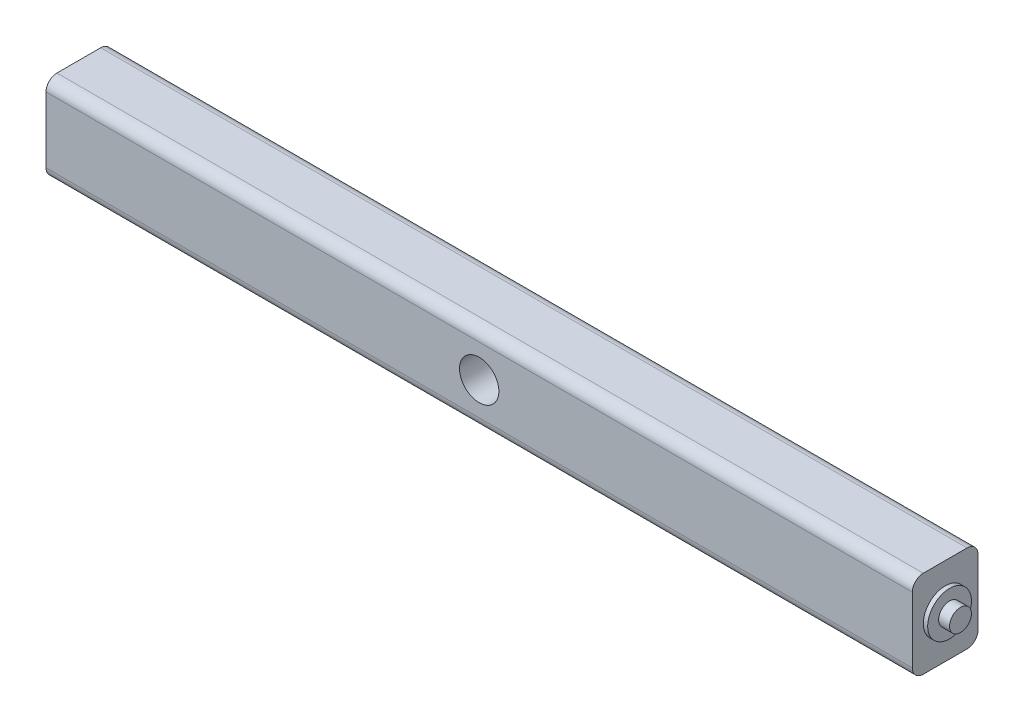
ISO-10303-21;
HEADER;
FILE_DESCRIPTION(('STEP AP214'),'2;1');
FILE_NAME('part.step','',(''),(''),'','','');
FILE_SCHEMA(('AUTOMOTIVE_DESIGN { 1 0 10303 214 1 1 1 1 }'));
ENDSEC;
DATA;
#1=APPLICATION_CONTEXT('core data for automotive mechanical design processes');
#2=APPLICATION_PROTOCOL_DEFINITION('international standard','automotive_design',2000,#1);
#3=PRODUCT_CONTEXT('',#1,'mechanical');
#4=PRODUCT('Part','Part','',(#3));
#5=PRODUCT_RELATED_PRODUCT_CATEGORY('part','',(#4));
#6=PRODUCT_DEFINITION_FORMATION('','',#4);
#7=PRODUCT_DEFINITION_CONTEXT('part definition',#1,'design');
#8=PRODUCT_DEFINITION('design','',#6,#7);
#9=PRODUCT_DEFINITION_SHAPE('','',#8);
#10=(LENGTH_UNIT() NAMED_UNIT(*) SI_UNIT(.MILLI.,.METRE.));
#11=(NAMED_UNIT(*) PLANE_ANGLE_UNIT() SI_UNIT($,.RADIAN.));
#12=(NAMED_UNIT(*) SI_UNIT($,.STERADIAN.) SOLID_ANGLE_UNIT());
#13=UNCERTAINTY_MEASURE_WITH_UNIT(LENGTH_MEASURE(1.E-05),#10,'distance_accuracy_value','');
#14=(GEOMETRIC_REPRESENTATION_CONTEXT(3) GLOBAL_UNCERTAINTY_ASSIGNED_CONTEXT((#13)) GLOBAL_UNIT_ASSIGNED_CONTEXT((#10,
#11,#12)) REPRESENTATION_CONTEXT('',''));
#15=CARTESIAN_POINT('',(0.,0.,0.));
#16=DIRECTION('',(0.,0.,1.));
#17=DIRECTION('',(1.,0.,0.));
#18=AXIS2_PLACEMENT_3D('',#15,#16,#17);
#19=CARTESIAN_POINT('',(-20.,-20.,15.));
#20=DIRECTION('',(0.,1.,0.));
#21=DIRECTION('',(0.,0.,1.));
#22=AXIS2_PLACEMENT_3D('',#19,#20,#21);
#23=PLANE('',#22);
#24=DIRECTION('',(0.,0.,1.));
#25=VECTOR('',#24,1.);
#26=CARTESIAN_POINT('',(-198.,-20.,-15.));
#27=LINE('',#26,#25);
#28=CARTESIAN_POINT('',(-198.,-20.,-10.));
#29=VERTEX_POINT('',#28);
#30=CARTESIAN_POINT('',(-198.,-20.,10.));
#31=VERTEX_POINT('',#30);
#32=EDGE_CURVE('E129',#29,#31,#27,.T.);
#33=ORIENTED_EDGE('',*,*,#32,.F.);
#34=DIRECTION('',(1.,0.,0.));
#35=VECTOR('',#34,1.);
#36=CARTESIAN_POINT('',(-20.,-20.,-10.));
#37=LINE('',#36,#35);
#38=CARTESIAN_POINT('',(198.,-20.,-10.));
#39=VERTEX_POINT('',#38);
#40=EDGE_CURVE('E156',#29,#39,#37,.T.);
#41=ORIENTED_EDGE('',*,*,#40,.T.);
#42=DIRECTION('',(0.,0.,-1.));
#43=VECTOR('',#42,1.);
#44=CARTESIAN_POINT('',(198.,-20.,15.));
#45=LINE('',#44,#43);
#46=CARTESIAN_POINT('',(198.,-20.,10.));
#47=VERTEX_POINT('',#46);
#48=EDGE_CURVE('E163',#47,#39,#45,.T.);
#49=ORIENTED_EDGE('',*,*,#48,.F.);
#50=DIRECTION('',(1.,0.,0.));
#51=VECTOR('',#50,1.);
#52=CARTESIAN_POINT('',(-198.,-20.,10.));
#53=LINE('',#52,#51);
#54=EDGE_CURVE('E118',#47,#31,#53,.F.);
#55=ORIENTED_EDGE('',*,*,#54,.T.);
#56=EDGE_LOOP('',(#33,#41,#49,#55));
#57=FACE_BOUND('',#56,.T.);
#58=ADVANCED_FACE('F42',(#57),#23,.F.);
#59=CARTESIAN_POINT('',(-20.,20.,15.));
#60=DIRECTION('',(0.,1.,0.));
#61=DIRECTION('',(0.,0.,1.));
#62=AXIS2_PLACEMENT_3D('',#59,#60,#61);
#63=PLANE('',#62);
#64=DIRECTION('',(0.,0.,1.));
#65=VECTOR('',#64,1.);
#66=CARTESIAN_POINT('',(198.,20.,15.));
#67=LINE('',#66,#65);
#68=CARTESIAN_POINT('',(198.,20.,-10.));
#69=VERTEX_POINT('',#68);
#70=CARTESIAN_POINT('',(198.,20.,10.));
#71=VERTEX_POINT('',#70);
#72=EDGE_CURVE('E172',#69,#71,#67,.T.);
#73=ORIENTED_EDGE('',*,*,#72,.F.);
#74=DIRECTION('',(1.,0.,0.));
#75=VECTOR('',#74,1.);
#76=CARTESIAN_POINT('',(-198.,20.,-10.));
#77=LINE('',#76,#75);
#78=CARTESIAN_POINT('',(-198.,20.,-10.));
#79=VERTEX_POINT('',#78);
#80=EDGE_CURVE('E149',#69,#79,#77,.F.);
#81=ORIENTED_EDGE('',*,*,#80,.T.);
#82=DIRECTION('',(0.,0.,-1.));
#83=VECTOR('',#82,1.);
#84=CARTESIAN_POINT('',(-198.,20.,-15.));
#85=LINE('',#84,#83);
#86=CARTESIAN_POINT('',(-198.,20.,10.));
#87=VERTEX_POINT('',#86);
#88=EDGE_CURVE('E114',#87,#79,#85,.T.);
#89=ORIENTED_EDGE('',*,*,#88,.F.);
#90=DIRECTION('',(1.,0.,0.));
#91=VECTOR('',#90,1.);
#92=CARTESIAN_POINT('',(-20.,20.,10.));
#93=LINE('',#92,#91);
#94=EDGE_CURVE('E146',#87,#71,#93,.T.);
#95=ORIENTED_EDGE('',*,*,#94,.T.);
#96=EDGE_LOOP('',(#73,#81,#89,#95));
#97=FACE_BOUND('',#96,.T.);
#98=ADVANCED_FACE('F229',(#97),#63,.T.);
#99=CARTESIAN_POINT('',(0.,0.,15.));
#100=DIRECTION('',(0.,0.,1.));
#101=DIRECTION('',(1.,0.,0.));
#102=AXIS2_PLACEMENT_3D('',#99,#100,#101);
#103=PLANE('',#102);
#104=CARTESIAN_POINT('',(0.,0.,15.));
#105=DIRECTION('',(0.,0.,1.));
#106=DIRECTION('',(1.,0.,0.));
#107=AXIS2_PLACEMENT_3D('',#104,#105,#106);
#108=CIRCLE('',#107,9.);
#109=CARTESIAN_POINT('',(9.,0.,15.));
#110=VERTEX_POINT('',#109);
#111=EDGE_CURVE('E187',#110,#110,#108,.T.);
#112=ORIENTED_EDGE('',*,*,#111,.F.);
#113=EDGE_LOOP('',(#112));
#114=FACE_BOUND('',#113,.T.);
#115=DIRECTION('',(0.,1.,0.));
#116=VECTOR('',#115,1.);
#117=CARTESIAN_POINT('',(-198.,20.,15.));
#118=LINE('',#117,#116);
#119=CARTESIAN_POINT('',(-198.,-15.,15.));
#120=VERTEX_POINT('',#119);
#121=CARTESIAN_POINT('',(-198.,15.,15.));
#122=VERTEX_POINT('',#121);
#123=EDGE_CURVE('E179',#120,#122,#118,.T.);
#124=ORIENTED_EDGE('',*,*,#123,.F.);
#125=DIRECTION('',(1.,0.,0.));
#126=VECTOR('',#125,1.);
#127=CARTESIAN_POINT('',(198.,-15.,15.));
#128=LINE('',#127,#126);
#129=CARTESIAN_POINT('',(198.,-15.,15.));
#130=VERTEX_POINT('',#129);
#131=EDGE_CURVE('E11',#120,#130,#128,.T.);
#132=ORIENTED_EDGE('',*,*,#131,.T.);
#133=DIRECTION('',(0.,-1.,0.));
#134=VECTOR('',#133,1.);
#135=CARTESIAN_POINT('',(198.,20.,15.));
#136=LINE('',#135,#134);
#137=CARTESIAN_POINT('',(198.,15.,15.));
#138=VERTEX_POINT('',#137);
#139=EDGE_CURVE('E170',#138,#130,#136,.T.);
#140=ORIENTED_EDGE('',*,*,#139,.F.);
#141=DIRECTION('',(1.,0.,0.));
#142=VECTOR('',#141,1.);
#143=CARTESIAN_POINT('',(0.,15.,15.));
#144=LINE('',#143,#142);
#145=EDGE_CURVE('E50',#138,#122,#144,.F.);
#146=ORIENTED_EDGE('',*,*,#145,.T.);
#147=EDGE_LOOP('',(#124,#132,#140,#146));
#148=FACE_BOUND('',#147,.T.);
#149=ADVANCED_FACE('F234',(#114,#148),#103,.T.);
#150=CARTESIAN_POINT('',(0.,0.,-15.));
#151=DIRECTION('',(0.,0.,1.));
#152=DIRECTION('',(1.,0.,0.));
#153=AXIS2_PLACEMENT_3D('',#150,#151,#152);
#154=PLANE('',#153);
#155=CARTESIAN_POINT('',(0.,0.,-15.));
#156=DIRECTION('',(0.,0.,1.));
#157=DIRECTION('',(1.,0.,0.));
#158=AXIS2_PLACEMENT_3D('',#155,#156,#157);
#159=CIRCLE('',#158,9.);
#160=CARTESIAN_POINT('',(9.,0.,-15.));
#161=VERTEX_POINT('',#160);
#162=EDGE_CURVE('E183',#161,#161,#159,.T.);
#163=ORIENTED_EDGE('',*,*,#162,.T.);
#164=EDGE_LOOP('',(#163));
#165=FACE_BOUND('',#164,.T.);
#166=DIRECTION('',(0.,-1.,0.));
#167=VECTOR('',#166,1.);
#168=CARTESIAN_POINT('',(-198.,20.,-15.));
#169=LINE('',#168,#167);
#170=CARTESIAN_POINT('',(-198.,15.,-15.));
#171=VERTEX_POINT('',#170);
#172=CARTESIAN_POINT('',(-198.,-15.,-15.));
#173=VERTEX_POINT('',#172);
#174=EDGE_CURVE('E111',#171,#173,#169,.T.);
#175=ORIENTED_EDGE('',*,*,#174,.F.);
#176=DIRECTION('',(1.,0.,0.));
#177=VECTOR('',#176,1.);
#178=CARTESIAN_POINT('',(198.,15.,-15.));
#179=LINE('',#178,#177);
#180=CARTESIAN_POINT('',(198.,15.,-15.));
#181=VERTEX_POINT('',#180);
#182=EDGE_CURVE('E125',#171,#181,#179,.T.);
#183=ORIENTED_EDGE('',*,*,#182,.T.);
#184=DIRECTION('',(0.,1.,0.));
#185=VECTOR('',#184,1.);
#186=CARTESIAN_POINT('',(198.,20.,-15.));
#187=LINE('',#186,#185);
#188=CARTESIAN_POINT('',(198.,-15.,-15.));
#189=VERTEX_POINT('',#188);
#190=EDGE_CURVE('E169',#189,#181,#187,.T.);
#191=ORIENTED_EDGE('',*,*,#190,.F.);
#192=DIRECTION('',(1.,0.,0.));
#193=VECTOR('',#192,1.);
#194=CARTESIAN_POINT('',(0.,-15.,-15.));
#195=LINE('',#194,#193);
#196=EDGE_CURVE('E128',#189,#173,#195,.F.);
#197=ORIENTED_EDGE('',*,*,#196,.T.);
#198=EDGE_LOOP('',(#175,#183,#191,#197));
#199=FACE_BOUND('',#198,.T.);
#200=ADVANCED_FACE('F123',(#165,#199),#154,.F.);
#201=CARTESIAN_POINT('',(0.,0.,-15.));
#202=DIRECTION('',(0.,0.,1.));
#203=DIRECTION('',(1.,0.,0.));
#204=AXIS2_PLACEMENT_3D('',#201,#202,#203);
#205=CYLINDRICAL_SURFACE('',#204,9.);
#206=ORIENTED_EDGE('',*,*,#162,.F.);
#207=EDGE_LOOP('',(#206));
#208=FACE_BOUND('',#207,.T.);
#209=ORIENTED_EDGE('',*,*,#111,.T.);
#210=EDGE_LOOP('',(#209));
#211=FACE_BOUND('',#210,.T.);
#212=ADVANCED_FACE('F279',(#208,#211),#205,.F.);
#213=CARTESIAN_POINT('',(-198.,0.,0.));
#214=DIRECTION('',(-1.,0.,0.));
#215=DIRECTION('',(0.,-1.,0.));
#216=AXIS2_PLACEMENT_3D('',#213,#214,#215);
#217=PLANE('',#216);
#218=CARTESIAN_POINT('',(-198.,0.,0.));
#219=DIRECTION('',(-1.,0.,0.));
#220=DIRECTION('',(0.,-1.,0.));
#221=AXIS2_PLACEMENT_3D('',#218,#219,#220);
#222=CIRCLE('',#221,10.);
#223=CARTESIAN_POINT('',(-198.,-10.,0.));
#224=VERTEX_POINT('',#223);
#225=EDGE_CURVE('E182',#224,#224,#222,.T.);
#226=ORIENTED_EDGE('',*,*,#225,.F.);
#227=EDGE_LOOP('',(#226));
#228=FACE_BOUND('',#227,.T.);
#229=ORIENTED_EDGE('',*,*,#88,.T.);
#230=CARTESIAN_POINT('',(-198.,15.,-10.));
#231=DIRECTION('',(-1.,0.,0.));
#232=DIRECTION('',(0.,-1.,0.));
#233=AXIS2_PLACEMENT_3D('',#230,#231,#232);
#234=CIRCLE('',#233,5.);
#235=EDGE_CURVE('E108',#79,#171,#234,.T.);
#236=ORIENTED_EDGE('',*,*,#235,.T.);
#237=ORIENTED_EDGE('',*,*,#174,.T.);
#238=CARTESIAN_POINT('',(-198.,-15.,-10.));
#239=DIRECTION('',(-1.,0.,0.));
#240=DIRECTION('',(0.,-1.,0.));
#241=AXIS2_PLACEMENT_3D('',#238,#239,#240);
#242=CIRCLE('',#241,5.);
#243=EDGE_CURVE('E119',#173,#29,#242,.T.);
#244=ORIENTED_EDGE('',*,*,#243,.T.);
#245=ORIENTED_EDGE('',*,*,#32,.T.);
#246=CARTESIAN_POINT('',(-198.,-15.,10.));
#247=DIRECTION('',(-1.,0.,0.));
#248=DIRECTION('',(0.,-1.,0.));
#249=AXIS2_PLACEMENT_3D('',#246,#247,#248);
#250=CIRCLE('',#249,5.);
#251=EDGE_CURVE('E63',#31,#120,#250,.T.);
#252=ORIENTED_EDGE('',*,*,#251,.T.);
#253=ORIENTED_EDGE('',*,*,#123,.T.);
#254=CARTESIAN_POINT('',(-198.,15.,10.));
#255=DIRECTION('',(-1.,0.,0.));
#256=DIRECTION('',(0.,-1.,0.));
#257=AXIS2_PLACEMENT_3D('',#254,#255,#256);
#258=CIRCLE('',#257,5.);
#259=EDGE_CURVE('E151',#122,#87,#258,.T.);
#260=ORIENTED_EDGE('',*,*,#259,.T.);
#261=EDGE_LOOP('',(#229,#236,#237,#244,#245,#252,#253,#260));
#262=FACE_BOUND('',#261,.T.);
#263=ADVANCED_FACE('F110',(#228,#262),#217,.T.);
#264=CARTESIAN_POINT('',(-205.,0.,0.));
#265=DIRECTION('',(1.,0.,0.));
#266=DIRECTION('',(0.,0.,-1.));
#267=AXIS2_PLACEMENT_3D('',#264,#265,#266);
#268=PLANE('',#267);
#269=CARTESIAN_POINT('',(-205.,0.,0.));
#270=DIRECTION('',(-1.,0.,0.));
#271=DIRECTION('',(0.,0.,1.));
#272=AXIS2_PLACEMENT_3D('',#269,#270,#271);
#273=CIRCLE('',#272,5.);
#274=CARTESIAN_POINT('',(-205.,0.,5.));
#275=VERTEX_POINT('',#274);
#276=EDGE_CURVE('E199',#275,#275,#273,.T.);
#277=ORIENTED_EDGE('',*,*,#276,.T.);
#278=EDGE_LOOP('',(#277));
#279=FACE_BOUND('',#278,.T.);
#280=ADVANCED_FACE('F249',(#279),#268,.F.);
#281=CARTESIAN_POINT('',(-200.,0.,0.));
#282=DIRECTION('',(-1.,0.,0.));
#283=DIRECTION('',(0.,0.,1.));
#284=AXIS2_PLACEMENT_3D('',#281,#282,#283);
#285=CYLINDRICAL_SURFACE('',#284,5.);
#286=CARTESIAN_POINT('',(-200.,0.,0.));
#287=DIRECTION('',(-1.,0.,0.));
#288=DIRECTION('',(0.,0.,1.));
#289=AXIS2_PLACEMENT_3D('',#286,#287,#288);
#290=CIRCLE('',#289,5.);
#291=CARTESIAN_POINT('',(-200.,0.,5.));
#292=VERTEX_POINT('',#291);
#293=EDGE_CURVE('E196',#292,#292,#290,.T.);
#294=ORIENTED_EDGE('',*,*,#293,.T.);
#295=EDGE_LOOP('',(#294));
#296=FACE_BOUND('',#295,.T.);
#297=ORIENTED_EDGE('',*,*,#276,.F.);
#298=EDGE_LOOP('',(#297));
#299=FACE_BOUND('',#298,.T.);
#300=ADVANCED_FACE('F246',(#296,#299),#285,.T.);
#301=CARTESIAN_POINT('',(-200.,0.,0.));
#302=DIRECTION('',(-1.,0.,0.));
#303=DIRECTION('',(0.,0.,1.));
#304=AXIS2_PLACEMENT_3D('',#301,#302,#303);
#305=PLANE('',#304);
#306=ORIENTED_EDGE('',*,*,#293,.F.);
#307=EDGE_LOOP('',(#306));
#308=FACE_BOUND('',#307,.T.);
#309=CARTESIAN_POINT('',(-200.,0.,0.));
#310=DIRECTION('',(-1.,0.,0.));
#311=DIRECTION('',(0.,0.,1.));
#312=AXIS2_PLACEMENT_3D('',#309,#310,#311);
#313=CIRCLE('',#312,10.);
#314=CARTESIAN_POINT('',(-200.,0.,10.));
#315=VERTEX_POINT('',#314);
#316=EDGE_CURVE('E138',#315,#315,#313,.T.);
#317=ORIENTED_EDGE('',*,*,#316,.T.);
#318=EDGE_LOOP('',(#317));
#319=FACE_BOUND('',#318,.T.);
#320=ADVANCED_FACE('F224',(#308,#319),#305,.T.);
#321=CARTESIAN_POINT('',(205.,0.,0.));
#322=DIRECTION('',(-1.,0.,0.));
#323=DIRECTION('',(0.,0.,1.));
#324=AXIS2_PLACEMENT_3D('',#321,#322,#323);
#325=CYLINDRICAL_SURFACE('',#324,10.);
#326=ORIENTED_EDGE('',*,*,#225,.T.);
#327=EDGE_LOOP('',(#326));
#328=FACE_BOUND('',#327,.T.);
#329=ORIENTED_EDGE('',*,*,#316,.F.);
#330=EDGE_LOOP('',(#329));
#331=FACE_BOUND('',#330,.T.);
#332=ADVANCED_FACE('F215',(#328,#331),#325,.T.);
#333=CARTESIAN_POINT('',(198.,0.,0.));
#334=DIRECTION('',(1.,0.,0.));
#335=DIRECTION('',(0.,0.,-1.));
#336=AXIS2_PLACEMENT_3D('',#333,#334,#335);
#337=PLANE('',#336);
#338=CARTESIAN_POINT('',(198.,0.,0.));
#339=DIRECTION('',(1.,0.,0.));
#340=DIRECTION('',(0.,0.,-1.));
#341=AXIS2_PLACEMENT_3D('',#338,#339,#340);
#342=CIRCLE('',#341,10.);
#343=CARTESIAN_POINT('',(198.,0.,-10.));
#344=VERTEX_POINT('',#343);
#345=EDGE_CURVE('E130',#344,#344,#342,.T.);
#346=ORIENTED_EDGE('',*,*,#345,.F.);
#347=EDGE_LOOP('',(#346));
#348=FACE_BOUND('',#347,.T.);
#349=ORIENTED_EDGE('',*,*,#190,.T.);
#350=CARTESIAN_POINT('',(198.,15.,-10.));
#351=DIRECTION('',(1.,0.,0.));
#352=DIRECTION('',(0.,0.,-1.));
#353=AXIS2_PLACEMENT_3D('',#350,#351,#352);
#354=CIRCLE('',#353,5.);
#355=EDGE_CURVE('E133',#181,#69,#354,.T.);
#356=ORIENTED_EDGE('',*,*,#355,.T.);
#357=ORIENTED_EDGE('',*,*,#72,.T.);
#358=CARTESIAN_POINT('',(198.,15.,10.));
#359=DIRECTION('',(1.,0.,0.));
#360=DIRECTION('',(0.,0.,-1.));
#361=AXIS2_PLACEMENT_3D('',#358,#359,#360);
#362=CIRCLE('',#361,5.);
#363=EDGE_CURVE('E134',#71,#138,#362,.T.);
#364=ORIENTED_EDGE('',*,*,#363,.T.);
#365=ORIENTED_EDGE('',*,*,#139,.T.);
#366=CARTESIAN_POINT('',(198.,-15.,10.));
#367=DIRECTION('',(1.,0.,0.));
#368=DIRECTION('',(0.,0.,-1.));
#369=AXIS2_PLACEMENT_3D('',#366,#367,#368);
#370=CIRCLE('',#369,5.);
#371=EDGE_CURVE('E136',#130,#47,#370,.T.);
#372=ORIENTED_EDGE('',*,*,#371,.T.);
#373=ORIENTED_EDGE('',*,*,#48,.T.);
#374=CARTESIAN_POINT('',(198.,-15.,-10.));
#375=DIRECTION('',(1.,0.,0.));
#376=DIRECTION('',(0.,0.,-1.));
#377=AXIS2_PLACEMENT_3D('',#374,#375,#376);
#378=CIRCLE('',#377,5.);
#379=EDGE_CURVE('E143',#39,#189,#378,.T.);
#380=ORIENTED_EDGE('',*,*,#379,.T.);
#381=EDGE_LOOP('',(#349,#356,#357,#364,#365,#372,#373,#380));
#382=FACE_BOUND('',#381,.T.);
#383=ADVANCED_FACE('F167',(#348,#382),#337,.T.);
#384=CARTESIAN_POINT('',(205.,0.,0.));
#385=DIRECTION('',(1.,0.,0.));
#386=DIRECTION('',(0.,0.,-1.));
#387=AXIS2_PLACEMENT_3D('',#384,#385,#386);
#388=PLANE('',#387);
#389=CARTESIAN_POINT('',(205.,0.,0.));
#390=DIRECTION('',(-1.,0.,0.));
#391=DIRECTION('',(0.,0.,1.));
#392=AXIS2_PLACEMENT_3D('',#389,#390,#391);
#393=CIRCLE('',#392,5.);
#394=CARTESIAN_POINT('',(205.,0.,5.));
#395=VERTEX_POINT('',#394);
#396=EDGE_CURVE('E186',#395,#395,#393,.T.);
#397=ORIENTED_EDGE('',*,*,#396,.F.);
#398=EDGE_LOOP('',(#397));
#399=FACE_BOUND('',#398,.T.);
#400=ADVANCED_FACE('F214',(#399),#388,.T.);
#401=CARTESIAN_POINT('',(200.,0.,0.));
#402=DIRECTION('',(1.,0.,0.));
#403=DIRECTION('',(0.,0.,-1.));
#404=AXIS2_PLACEMENT_3D('',#401,#402,#403);
#405=CYLINDRICAL_SURFACE('',#404,5.);
#406=CARTESIAN_POINT('',(200.,0.,0.));
#407=DIRECTION('',(-1.,0.,0.));
#408=DIRECTION('',(0.,0.,1.));
#409=AXIS2_PLACEMENT_3D('',#406,#407,#408);
#410=CIRCLE('',#409,5.);
#411=CARTESIAN_POINT('',(200.,0.,5.));
#412=VERTEX_POINT('',#411);
#413=EDGE_CURVE('E190',#412,#412,#410,.T.);
#414=ORIENTED_EDGE('',*,*,#413,.F.);
#415=EDGE_LOOP('',(#414));
#416=FACE_BOUND('',#415,.T.);
#417=ORIENTED_EDGE('',*,*,#396,.T.);
#418=EDGE_LOOP('',(#417));
#419=FACE_BOUND('',#418,.T.);
#420=ADVANCED_FACE('F221',(#416,#419),#405,.T.);
#421=CARTESIAN_POINT('',(200.,0.,0.));
#422=DIRECTION('',(1.,0.,0.));
#423=DIRECTION('',(0.,0.,1.));
#424=AXIS2_PLACEMENT_3D('',#421,#422,#423);
#425=PLANE('',#424);
#426=ORIENTED_EDGE('',*,*,#413,.T.);
#427=EDGE_LOOP('',(#426));
#428=FACE_BOUND('',#427,.T.);
#429=CARTESIAN_POINT('',(200.,0.,0.));
#430=DIRECTION('',(1.,0.,0.));
#431=DIRECTION('',(0.,0.,-1.));
#432=AXIS2_PLACEMENT_3D('',#429,#430,#431);
#433=CIRCLE('',#432,10.);
#434=CARTESIAN_POINT('',(200.,0.,-10.));
#435=VERTEX_POINT('',#434);
#436=EDGE_CURVE('E193',#435,#435,#433,.T.);
#437=ORIENTED_EDGE('',*,*,#436,.T.);
#438=EDGE_LOOP('',(#437));
#439=FACE_BOUND('',#438,.T.);
#440=ADVANCED_FACE('F241',(#428,#439),#425,.T.);
#441=ORIENTED_EDGE('',*,*,#345,.T.);
#442=EDGE_LOOP('',(#441));
#443=FACE_BOUND('',#442,.T.);
#444=ORIENTED_EDGE('',*,*,#436,.F.);
#445=EDGE_LOOP('',(#444));
#446=FACE_BOUND('',#445,.T.);
#447=ADVANCED_FACE('F210',(#443,#446),#325,.T.);
#448=CARTESIAN_POINT('',(0.,15.,-10.));
#449=DIRECTION('',(-1.,0.,0.));
#450=DIRECTION('',(0.,0.,1.));
#451=AXIS2_PLACEMENT_3D('',#448,#449,#450);
#452=CYLINDRICAL_SURFACE('',#451,5.);
#453=ORIENTED_EDGE('',*,*,#235,.F.);
#454=ORIENTED_EDGE('',*,*,#80,.F.);
#455=ORIENTED_EDGE('',*,*,#355,.F.);
#456=ORIENTED_EDGE('',*,*,#182,.F.);
#457=EDGE_LOOP('',(#453,#454,#455,#456));
#458=FACE_BOUND('',#457,.T.);
#459=ADVANCED_FACE('F132',(#458),#452,.T.);
#460=CARTESIAN_POINT('',(-20.,-15.,-10.));
#461=DIRECTION('',(1.,0.,0.));
#462=DIRECTION('',(0.,0.,-1.));
#463=AXIS2_PLACEMENT_3D('',#460,#461,#462);
#464=CYLINDRICAL_SURFACE('',#463,5.);
#465=ORIENTED_EDGE('',*,*,#243,.F.);
#466=ORIENTED_EDGE('',*,*,#196,.F.);
#467=ORIENTED_EDGE('',*,*,#379,.F.);
#468=ORIENTED_EDGE('',*,*,#40,.F.);
#469=EDGE_LOOP('',(#465,#466,#467,#468));
#470=FACE_BOUND('',#469,.T.);
#471=ADVANCED_FACE('F260',(#470),#464,.T.);
#472=CARTESIAN_POINT('',(0.,-15.,10.));
#473=DIRECTION('',(-1.,0.,0.));
#474=DIRECTION('',(0.,0.,1.));
#475=AXIS2_PLACEMENT_3D('',#472,#473,#474);
#476=CYLINDRICAL_SURFACE('',#475,5.);
#477=ORIENTED_EDGE('',*,*,#251,.F.);
#478=ORIENTED_EDGE('',*,*,#54,.F.);
#479=ORIENTED_EDGE('',*,*,#371,.F.);
#480=ORIENTED_EDGE('',*,*,#131,.F.);
#481=EDGE_LOOP('',(#477,#478,#479,#480));
#482=FACE_BOUND('',#481,.T.);
#483=ADVANCED_FACE('F262',(#482),#476,.T.);
#484=CARTESIAN_POINT('',(-20.,15.,10.));
#485=DIRECTION('',(1.,0.,0.));
#486=DIRECTION('',(0.,0.,-1.));
#487=AXIS2_PLACEMENT_3D('',#484,#485,#486);
#488=CYLINDRICAL_SURFACE('',#487,5.);
#489=ORIENTED_EDGE('',*,*,#259,.F.);
#490=ORIENTED_EDGE('',*,*,#145,.F.);
#491=ORIENTED_EDGE('',*,*,#363,.F.);
#492=ORIENTED_EDGE('',*,*,#94,.F.);
#493=EDGE_LOOP('',(#489,#490,#491,#492));
#494=FACE_BOUND('',#493,.T.);
#495=ADVANCED_FACE('F44',(#494),#488,.T.);
#496=CLOSED_SHELL('',(#58,#98,#149,#200,#212,#263,#280,#300,#320,#332,#383,#400,#420,#440,#447,
#459,#471,#483,#495));
#497=MANIFOLD_SOLID_BREP('B2',#496);
#498=ADVANCED_BREP_SHAPE_REPRESENTATION('',(#18,#497),#14);
#499=SHAPE_DEFINITION_REPRESENTATION(#9,#498);
ENDSEC;
END-ISO-10303-21;
